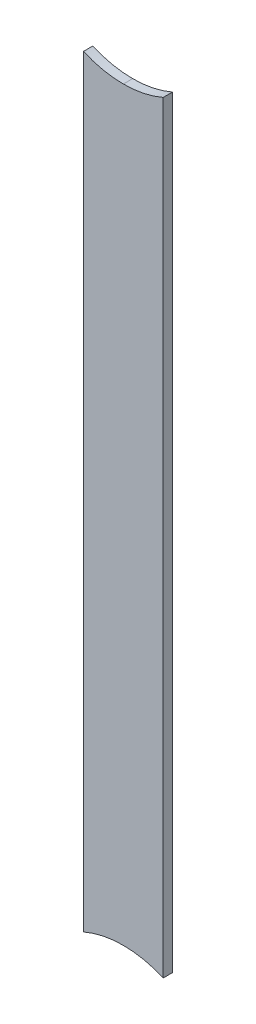
ISO-10303-21;
HEADER;
FILE_DESCRIPTION(('STEP AP214'),'2;1');
FILE_NAME('part.step','',(''),(''),'','','');
FILE_SCHEMA(('AUTOMOTIVE_DESIGN { 1 0 10303 214 1 1 1 1 }'));
ENDSEC;
DATA;
#1=APPLICATION_CONTEXT('core data for automotive mechanical design processes');
#2=APPLICATION_PROTOCOL_DEFINITION('international standard','automotive_design',2000,#1);
#3=PRODUCT_CONTEXT('',#1,'mechanical');
#4=PRODUCT('Part','Part','',(#3));
#5=PRODUCT_RELATED_PRODUCT_CATEGORY('part','',(#4));
#6=PRODUCT_DEFINITION_FORMATION('','',#4);
#7=PRODUCT_DEFINITION_CONTEXT('part definition',#1,'design');
#8=PRODUCT_DEFINITION('design','',#6,#7);
#9=PRODUCT_DEFINITION_SHAPE('','',#8);
#10=(LENGTH_UNIT() NAMED_UNIT(*) SI_UNIT(.MILLI.,.METRE.));
#11=(NAMED_UNIT(*) PLANE_ANGLE_UNIT() SI_UNIT($,.RADIAN.));
#12=(NAMED_UNIT(*) SI_UNIT($,.STERADIAN.) SOLID_ANGLE_UNIT());
#13=UNCERTAINTY_MEASURE_WITH_UNIT(LENGTH_MEASURE(1.E-05),#10,'distance_accuracy_value','');
#14=(GEOMETRIC_REPRESENTATION_CONTEXT(3) GLOBAL_UNCERTAINTY_ASSIGNED_CONTEXT((#13)) GLOBAL_UNIT_ASSIGNED_CONTEXT((#10,
#11,#12)) REPRESENTATION_CONTEXT('',''));
#15=CARTESIAN_POINT('',(0.,0.,0.));
#16=DIRECTION('',(0.,0.,1.));
#17=DIRECTION('',(1.,0.,0.));
#18=AXIS2_PLACEMENT_3D('',#15,#16,#17);
#19=CARTESIAN_POINT('',(165.608,-72.644,-0.045));
#20=DIRECTION('',(0.,0.,-1.));
#21=DIRECTION('',(0.,-1.,0.));
#22=AXIS2_PLACEMENT_3D('',#19,#20,#21);
#23=CYLINDRICAL_SURFACE('',#22,0.375);
#24=DIRECTION('',(0.,0.,1.));
#25=VECTOR('',#24,1.);
#26=CARTESIAN_POINT('',(165.608,-73.019,-0.045));
#27=LINE('',#26,#25);
#28=CARTESIAN_POINT('',(165.608,-73.019,-0.035));
#29=VERTEX_POINT('',#28);
#30=CARTESIAN_POINT('',(165.608,-73.019,0.));
#31=VERTEX_POINT('',#30);
#32=EDGE_CURVE('E87',#29,#31,#27,.T.);
#33=ORIENTED_EDGE('',*,*,#32,.F.);
#34=CARTESIAN_POINT('',(165.608,-72.644,-0.035));
#35=DIRECTION('',(0.,0.,-1.));
#36=DIRECTION('',(0.,-1.,0.));
#37=AXIS2_PLACEMENT_3D('',#34,#35,#36);
#38=CIRCLE('',#37,0.375);
#39=CARTESIAN_POINT('',(165.458,-72.98769317712,-0.035));
#40=VERTEX_POINT('',#39);
#41=EDGE_CURVE('E118',#29,#40,#38,.T.);
#42=ORIENTED_EDGE('',*,*,#41,.T.);
#43=DIRECTION('',(0.,0.,-1.));
#44=VECTOR('',#43,1.);
#45=CARTESIAN_POINT('',(165.458,-72.98769317712,-0.045));
#46=LINE('',#45,#44);
#47=CARTESIAN_POINT('',(165.458,-72.98769317712,0.));
#48=VERTEX_POINT('',#47);
#49=EDGE_CURVE('E11',#48,#40,#46,.T.);
#50=ORIENTED_EDGE('',*,*,#49,.F.);
#51=CARTESIAN_POINT('',(165.608,-72.644,0.));
#52=DIRECTION('',(0.,0.,-1.));
#53=DIRECTION('',(0.,-1.,0.));
#54=AXIS2_PLACEMENT_3D('',#51,#52,#53);
#55=CIRCLE('',#54,0.375);
#56=EDGE_CURVE('E130',#31,#48,#55,.T.);
#57=ORIENTED_EDGE('',*,*,#56,.F.);
#58=EDGE_LOOP('',(#33,#42,#50,#57));
#59=FACE_BOUND('',#58,.T.);
#60=ADVANCED_FACE('F17',(#59),#23,.F.);
#61=CARTESIAN_POINT('',(165.458,-72.644,-0.035));
#62=DIRECTION('',(1.,0.,0.));
#63=DIRECTION('',(0.,1.,0.));
#64=AXIS2_PLACEMENT_3D('',#61,#62,#63);
#65=PLANE('',#64);
#66=DIRECTION('',(0.,0.,-1.));
#67=VECTOR('',#66,1.);
#68=CARTESIAN_POINT('',(165.458,-75.85630682287,-0.045));
#69=LINE('',#68,#67);
#70=CARTESIAN_POINT('',(165.458,-75.85630682285,0.));
#71=VERTEX_POINT('',#70);
#72=CARTESIAN_POINT('',(165.458,-75.85630682285,-0.035));
#73=VERTEX_POINT('',#72);
#74=EDGE_CURVE('E25',#71,#73,#69,.T.);
#75=ORIENTED_EDGE('',*,*,#74,.F.);
#76=DIRECTION('',(0.,-1.,0.));
#77=VECTOR('',#76,1.);
#78=CARTESIAN_POINT('',(165.458,-72.644,0.));
#79=LINE('',#78,#77);
#80=EDGE_CURVE('E115',#48,#71,#79,.T.);
#81=ORIENTED_EDGE('',*,*,#80,.F.);
#82=ORIENTED_EDGE('',*,*,#49,.T.);
#83=DIRECTION('',(0.,-1.,0.));
#84=VECTOR('',#83,1.);
#85=CARTESIAN_POINT('',(165.458,-72.644,-0.035));
#86=LINE('',#85,#84);
#87=EDGE_CURVE('E99',#40,#73,#86,.T.);
#88=ORIENTED_EDGE('',*,*,#87,.T.);
#89=EDGE_LOOP('',(#75,#81,#82,#88));
#90=FACE_BOUND('',#89,.T.);
#91=ADVANCED_FACE('F141',(#90),#65,.F.);
#92=CARTESIAN_POINT('',(165.608,-76.2,-0.045));
#93=DIRECTION('',(0.,0.,-1.));
#94=DIRECTION('',(0.,-1.,0.));
#95=AXIS2_PLACEMENT_3D('',#92,#93,#94);
#96=CYLINDRICAL_SURFACE('',#95,0.375);
#97=DIRECTION('',(0.,0.,-1.));
#98=VECTOR('',#97,1.);
#99=CARTESIAN_POINT('',(165.758,-75.85630682287,-0.045));
#100=LINE('',#99,#98);
#101=CARTESIAN_POINT('',(165.758,-75.85630682286,0.));
#102=VERTEX_POINT('',#101);
#103=CARTESIAN_POINT('',(165.758,-75.85630682286,-0.035));
#104=VERTEX_POINT('',#103);
#105=EDGE_CURVE('E82',#102,#104,#100,.T.);
#106=ORIENTED_EDGE('',*,*,#105,.F.);
#107=CARTESIAN_POINT('',(165.608,-76.2,0.));
#108=DIRECTION('',(0.,0.,-1.));
#109=DIRECTION('',(0.,-1.,0.));
#110=AXIS2_PLACEMENT_3D('',#107,#108,#109);
#111=CIRCLE('',#110,0.375);
#112=EDGE_CURVE('E127',#71,#102,#111,.T.);
#113=ORIENTED_EDGE('',*,*,#112,.F.);
#114=ORIENTED_EDGE('',*,*,#74,.T.);
#115=CARTESIAN_POINT('',(165.608,-76.2,-0.035));
#116=DIRECTION('',(0.,0.,-1.));
#117=DIRECTION('',(0.,-1.,0.));
#118=AXIS2_PLACEMENT_3D('',#115,#116,#117);
#119=CIRCLE('',#118,0.375);
#120=EDGE_CURVE('E77',#73,#104,#119,.T.);
#121=ORIENTED_EDGE('',*,*,#120,.T.);
#122=EDGE_LOOP('',(#106,#113,#114,#121));
#123=FACE_BOUND('',#122,.T.);
#124=ADVANCED_FACE('F79',(#123),#96,.F.);
#125=CARTESIAN_POINT('',(165.758,-76.2,0.));
#126=DIRECTION('',(0.,0.,1.));
#127=DIRECTION('',(1.,0.,0.));
#128=AXIS2_PLACEMENT_3D('',#125,#126,#127);
#129=PLANE('',#128);
#130=ORIENTED_EDGE('',*,*,#112,.T.);
#131=DIRECTION('',(0.,1.,0.));
#132=VECTOR('',#131,1.);
#133=CARTESIAN_POINT('',(165.758,-76.2,0.));
#134=LINE('',#133,#132);
#135=CARTESIAN_POINT('',(165.758,-72.98769317712,0.));
#136=VERTEX_POINT('',#135);
#137=EDGE_CURVE('E103',#102,#136,#134,.T.);
#138=ORIENTED_EDGE('',*,*,#137,.T.);
#139=CARTESIAN_POINT('',(165.608,-72.644,0.));
#140=DIRECTION('',(0.,0.,-1.));
#141=DIRECTION('',(0.,-1.,0.));
#142=AXIS2_PLACEMENT_3D('',#139,#140,#141);
#143=CIRCLE('',#142,0.375);
#144=EDGE_CURVE('E126',#136,#31,#143,.T.);
#145=ORIENTED_EDGE('',*,*,#144,.T.);
#146=ORIENTED_EDGE('',*,*,#56,.T.);
#147=ORIENTED_EDGE('',*,*,#80,.T.);
#148=EDGE_LOOP('',(#130,#138,#145,#146,#147));
#149=FACE_BOUND('',#148,.T.);
#150=ADVANCED_FACE('F138',(#149),#129,.T.);
#151=CARTESIAN_POINT('',(165.608,-72.644,-0.045));
#152=DIRECTION('',(0.,0.,-1.));
#153=DIRECTION('',(0.,-1.,0.));
#154=AXIS2_PLACEMENT_3D('',#151,#152,#153);
#155=CYLINDRICAL_SURFACE('',#154,0.375);
#156=CARTESIAN_POINT('',(165.608,-72.644,-0.035));
#157=DIRECTION('',(0.,0.,-1.));
#158=DIRECTION('',(0.,-1.,0.));
#159=AXIS2_PLACEMENT_3D('',#156,#157,#158);
#160=CIRCLE('',#159,0.375);
#161=CARTESIAN_POINT('',(165.758,-72.98769317712,-0.035));
#162=VERTEX_POINT('',#161);
#163=EDGE_CURVE('E88',#162,#29,#160,.T.);
#164=ORIENTED_EDGE('',*,*,#163,.T.);
#165=ORIENTED_EDGE('',*,*,#32,.T.);
#166=ORIENTED_EDGE('',*,*,#144,.F.);
#167=DIRECTION('',(0.,0.,-1.));
#168=VECTOR('',#167,1.);
#169=CARTESIAN_POINT('',(165.758,-72.98769317712,-0.045));
#170=LINE('',#169,#168);
#171=EDGE_CURVE('E110',#136,#162,#170,.T.);
#172=ORIENTED_EDGE('',*,*,#171,.T.);
#173=EDGE_LOOP('',(#164,#165,#166,#172));
#174=FACE_BOUND('',#173,.T.);
#175=ADVANCED_FACE('F140',(#174),#155,.F.);
#176=CARTESIAN_POINT('',(165.758,-76.2,-0.035));
#177=DIRECTION('',(0.,0.,1.));
#178=DIRECTION('',(1.,0.,0.));
#179=AXIS2_PLACEMENT_3D('',#176,#177,#178);
#180=PLANE('',#179);
#181=ORIENTED_EDGE('',*,*,#87,.F.);
#182=ORIENTED_EDGE('',*,*,#41,.F.);
#183=ORIENTED_EDGE('',*,*,#163,.F.);
#184=DIRECTION('',(0.,1.,0.));
#185=VECTOR('',#184,1.);
#186=CARTESIAN_POINT('',(165.758,-76.2,-0.035));
#187=LINE('',#186,#185);
#188=EDGE_CURVE('E91',#104,#162,#187,.T.);
#189=ORIENTED_EDGE('',*,*,#188,.F.);
#190=ORIENTED_EDGE('',*,*,#120,.F.);
#191=EDGE_LOOP('',(#181,#182,#183,#189,#190));
#192=FACE_BOUND('',#191,.T.);
#193=ADVANCED_FACE('F92',(#192),#180,.F.);
#194=CARTESIAN_POINT('',(165.758,-76.2,-0.035));
#195=DIRECTION('',(-1.,0.,0.));
#196=DIRECTION('',(0.,0.,1.));
#197=AXIS2_PLACEMENT_3D('',#194,#195,#196);
#198=PLANE('',#197);
#199=ORIENTED_EDGE('',*,*,#171,.F.);
#200=ORIENTED_EDGE('',*,*,#137,.F.);
#201=ORIENTED_EDGE('',*,*,#105,.T.);
#202=ORIENTED_EDGE('',*,*,#188,.T.);
#203=EDGE_LOOP('',(#199,#200,#201,#202));
#204=FACE_BOUND('',#203,.T.);
#205=ADVANCED_FACE('F101',(#204),#198,.F.);
#206=CLOSED_SHELL('',(#60,#91,#124,#150,#175,#193,#205));
#207=MANIFOLD_SOLID_BREP('B1',#206);
#208=ADVANCED_BREP_SHAPE_REPRESENTATION('',(#18,#207),#14);
#209=SHAPE_DEFINITION_REPRESENTATION(#9,#208);
ENDSEC;
END-ISO-10303-21;
